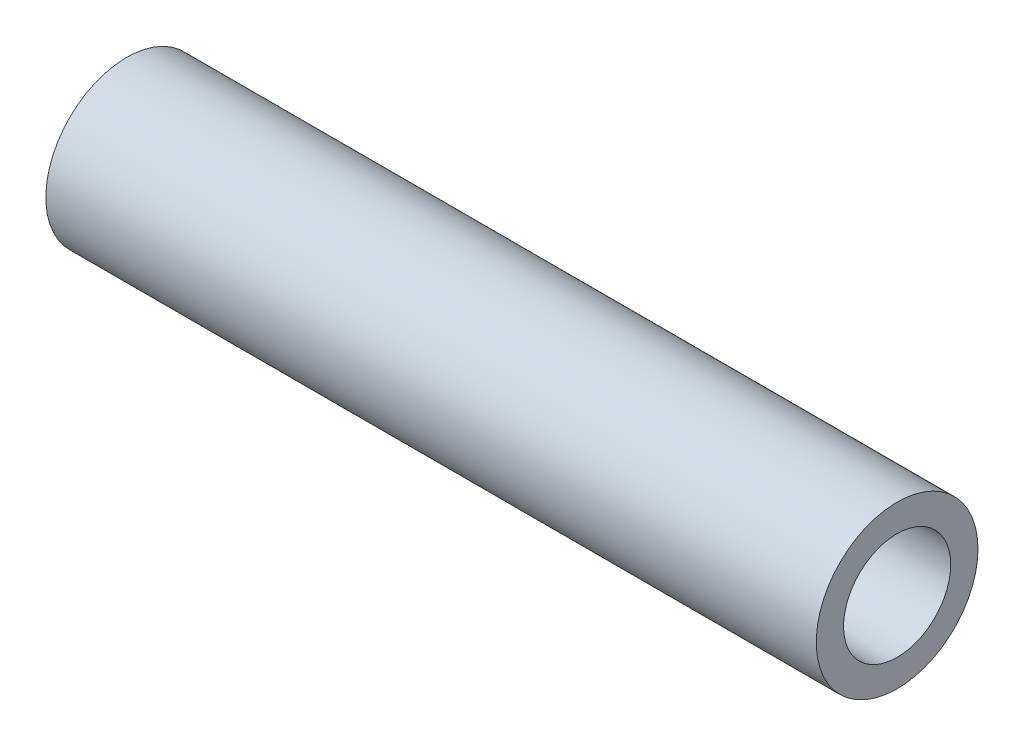
ISO-10303-21;
HEADER;
FILE_DESCRIPTION(('STEP AP214'),'2;1');
FILE_NAME('part.step','',(''),(''),'','','');
FILE_SCHEMA(('AUTOMOTIVE_DESIGN { 1 0 10303 214 1 1 1 1 }'));
ENDSEC;
DATA;
#1=APPLICATION_CONTEXT('core data for automotive mechanical design processes');
#2=APPLICATION_PROTOCOL_DEFINITION('international standard','automotive_design',2000,#1);
#3=PRODUCT_CONTEXT('',#1,'mechanical');
#4=PRODUCT('Part','Part','',(#3));
#5=PRODUCT_RELATED_PRODUCT_CATEGORY('part','',(#4));
#6=PRODUCT_DEFINITION_FORMATION('','',#4);
#7=PRODUCT_DEFINITION_CONTEXT('part definition',#1,'design');
#8=PRODUCT_DEFINITION('design','',#6,#7);
#9=PRODUCT_DEFINITION_SHAPE('','',#8);
#10=(LENGTH_UNIT() NAMED_UNIT(*) SI_UNIT(.MILLI.,.METRE.));
#11=(NAMED_UNIT(*) PLANE_ANGLE_UNIT() SI_UNIT($,.RADIAN.));
#12=(NAMED_UNIT(*) SI_UNIT($,.STERADIAN.) SOLID_ANGLE_UNIT());
#13=UNCERTAINTY_MEASURE_WITH_UNIT(LENGTH_MEASURE(1.E-05),#10,'distance_accuracy_value','');
#14=(GEOMETRIC_REPRESENTATION_CONTEXT(3) GLOBAL_UNCERTAINTY_ASSIGNED_CONTEXT((#13)) GLOBAL_UNIT_ASSIGNED_CONTEXT((#10,
#11,#12)) REPRESENTATION_CONTEXT('',''));
#15=CARTESIAN_POINT('',(0.,0.,0.));
#16=DIRECTION('',(0.,0.,1.));
#17=DIRECTION('',(1.,0.,0.));
#18=AXIS2_PLACEMENT_3D('',#15,#16,#17);
#19=CARTESIAN_POINT('',(38.1,0.,0.));
#20=DIRECTION('',(1.,0.,0.));
#21=DIRECTION('',(0.,0.,-1.));
#22=AXIS2_PLACEMENT_3D('',#19,#20,#21);
#23=PLANE('',#22);
#24=CARTESIAN_POINT('',(38.1,0.,0.));
#25=DIRECTION('',(1.,0.,0.));
#26=DIRECTION('',(0.,0.,-1.));
#27=AXIS2_PLACEMENT_3D('',#24,#25,#26);
#28=CIRCLE('',#27,4.);
#29=CARTESIAN_POINT('',(38.1,0.,-4.));
#30=VERTEX_POINT('',#29);
#31=EDGE_CURVE('E10',#30,#30,#28,.T.);
#32=ORIENTED_EDGE('',*,*,#31,.T.);
#33=EDGE_LOOP('',(#32));
#34=FACE_BOUND('',#33,.T.);
#35=CARTESIAN_POINT('',(38.1,0.,0.));
#36=DIRECTION('',(1.,0.,0.));
#37=DIRECTION('',(0.,0.,-1.));
#38=AXIS2_PLACEMENT_3D('',#35,#36,#37);
#39=CIRCLE('',#38,2.65);
#40=CARTESIAN_POINT('',(38.1,0.,-2.65));
#41=VERTEX_POINT('',#40);
#42=EDGE_CURVE('E41',#41,#41,#39,.T.);
#43=ORIENTED_EDGE('',*,*,#42,.F.);
#44=EDGE_LOOP('',(#43));
#45=FACE_BOUND('',#44,.T.);
#46=ADVANCED_FACE('F30',(#34,#45),#23,.T.);
#47=CARTESIAN_POINT('',(0.,0.,0.));
#48=DIRECTION('',(1.,0.,0.));
#49=DIRECTION('',(0.,0.,-1.));
#50=AXIS2_PLACEMENT_3D('',#47,#48,#49);
#51=PLANE('',#50);
#52=CARTESIAN_POINT('',(0.,0.,0.));
#53=DIRECTION('',(1.,0.,0.));
#54=DIRECTION('',(0.,0.,-1.));
#55=AXIS2_PLACEMENT_3D('',#52,#53,#54);
#56=CIRCLE('',#55,4.);
#57=CARTESIAN_POINT('',(0.,0.,-4.));
#58=VERTEX_POINT('',#57);
#59=EDGE_CURVE('E34',#58,#58,#56,.T.);
#60=ORIENTED_EDGE('',*,*,#59,.F.);
#61=EDGE_LOOP('',(#60));
#62=FACE_BOUND('',#61,.T.);
#63=CARTESIAN_POINT('',(0.,0.,0.));
#64=DIRECTION('',(1.,0.,0.));
#65=DIRECTION('',(0.,0.,-1.));
#66=AXIS2_PLACEMENT_3D('',#63,#64,#65);
#67=CIRCLE('',#66,2.65);
#68=CARTESIAN_POINT('',(0.,0.,-2.65));
#69=VERTEX_POINT('',#68);
#70=EDGE_CURVE('E43',#69,#69,#67,.T.);
#71=ORIENTED_EDGE('',*,*,#70,.T.);
#72=EDGE_LOOP('',(#71));
#73=FACE_BOUND('',#72,.T.);
#74=ADVANCED_FACE('F53',(#62,#73),#51,.F.);
#75=CARTESIAN_POINT('',(38.1,0.,0.));
#76=DIRECTION('',(-1.,0.,0.));
#77=DIRECTION('',(0.,0.,1.));
#78=AXIS2_PLACEMENT_3D('',#75,#76,#77);
#79=CYLINDRICAL_SURFACE('',#78,4.);
#80=ORIENTED_EDGE('',*,*,#31,.F.);
#81=EDGE_LOOP('',(#80));
#82=FACE_BOUND('',#81,.T.);
#83=ORIENTED_EDGE('',*,*,#59,.T.);
#84=EDGE_LOOP('',(#83));
#85=FACE_BOUND('',#84,.T.);
#86=ADVANCED_FACE('F32',(#82,#85),#79,.T.);
#87=CARTESIAN_POINT('',(38.1,0.,0.));
#88=DIRECTION('',(-1.,0.,0.));
#89=DIRECTION('',(0.,0.,1.));
#90=AXIS2_PLACEMENT_3D('',#87,#88,#89);
#91=CYLINDRICAL_SURFACE('',#90,2.65);
#92=ORIENTED_EDGE('',*,*,#42,.T.);
#93=EDGE_LOOP('',(#92));
#94=FACE_BOUND('',#93,.T.);
#95=ORIENTED_EDGE('',*,*,#70,.F.);
#96=EDGE_LOOP('',(#95));
#97=FACE_BOUND('',#96,.T.);
#98=ADVANCED_FACE('F49',(#94,#97),#91,.F.);
#99=CLOSED_SHELL('',(#46,#74,#86,#98));
#100=MANIFOLD_SOLID_BREP('B2',#99);
#101=ADVANCED_BREP_SHAPE_REPRESENTATION('',(#18,#100),#14);
#102=SHAPE_DEFINITION_REPRESENTATION(#9,#101);
ENDSEC;
END-ISO-10303-21;
